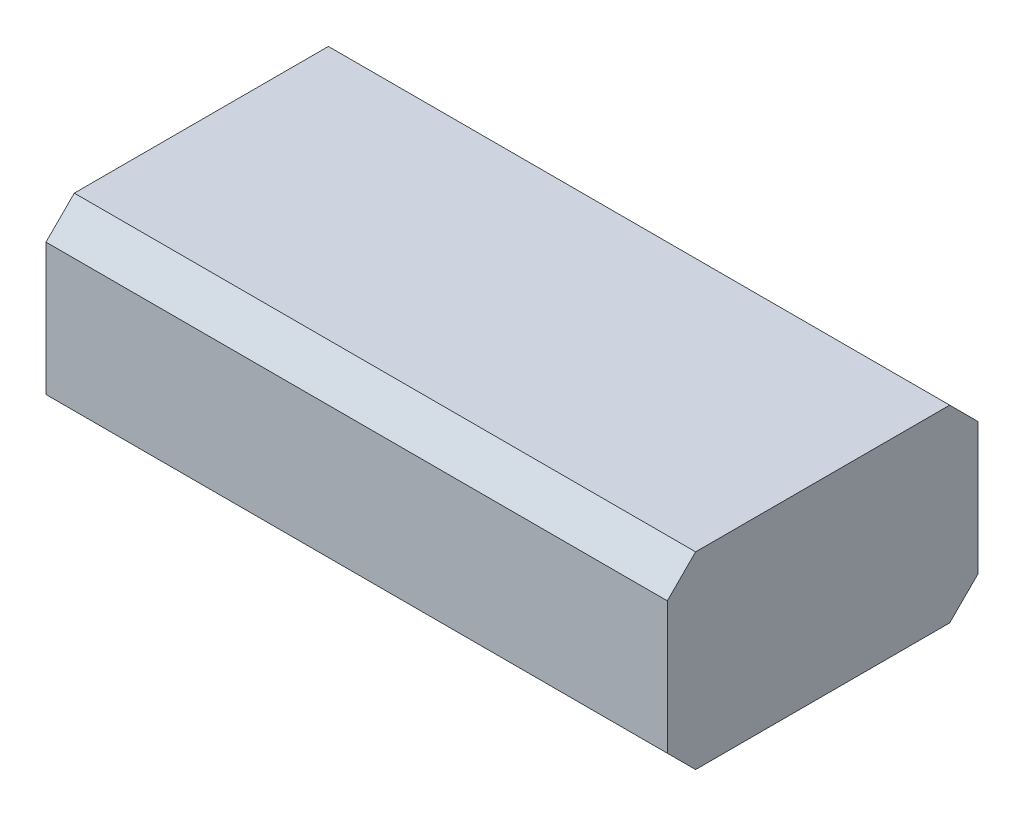
ISO-10303-21;
HEADER;
FILE_DESCRIPTION(('STEP AP214'),'2;1');
FILE_NAME('part.step','',(''),(''),'','','');
FILE_SCHEMA(('AUTOMOTIVE_DESIGN { 1 0 10303 214 1 1 1 1 }'));
ENDSEC;
DATA;
#1=APPLICATION_CONTEXT('core data for automotive mechanical design processes');
#2=APPLICATION_PROTOCOL_DEFINITION('international standard','automotive_design',2000,#1);
#3=PRODUCT_CONTEXT('',#1,'mechanical');
#4=PRODUCT('Part','Part','',(#3));
#5=PRODUCT_RELATED_PRODUCT_CATEGORY('part','',(#4));
#6=PRODUCT_DEFINITION_FORMATION('','',#4);
#7=PRODUCT_DEFINITION_CONTEXT('part definition',#1,'design');
#8=PRODUCT_DEFINITION('design','',#6,#7);
#9=PRODUCT_DEFINITION_SHAPE('','',#8);
#10=(LENGTH_UNIT() NAMED_UNIT(*) SI_UNIT(.MILLI.,.METRE.));
#11=(NAMED_UNIT(*) PLANE_ANGLE_UNIT() SI_UNIT($,.RADIAN.));
#12=(NAMED_UNIT(*) SI_UNIT($,.STERADIAN.) SOLID_ANGLE_UNIT());
#13=UNCERTAINTY_MEASURE_WITH_UNIT(LENGTH_MEASURE(1.E-05),#10,'distance_accuracy_value','');
#14=(GEOMETRIC_REPRESENTATION_CONTEXT(3) GLOBAL_UNCERTAINTY_ASSIGNED_CONTEXT((#13)) GLOBAL_UNIT_ASSIGNED_CONTEXT((#10,
#11,#12)) REPRESENTATION_CONTEXT('',''));
#15=CARTESIAN_POINT('',(0.,0.,0.));
#16=DIRECTION('',(0.,0.,1.));
#17=DIRECTION('',(1.,0.,0.));
#18=AXIS2_PLACEMENT_3D('',#15,#16,#17);
#19=CARTESIAN_POINT('',(0.,0.,0.3295));
#20=DIRECTION('',(1.,0.,0.));
#21=DIRECTION('',(0.,0.,-1.));
#22=AXIS2_PLACEMENT_3D('',#19,#20,#21);
#23=PLANE('',#22);
#24=DIRECTION('',(0.,0.,-1.));
#25=VECTOR('',#24,1.);
#26=CARTESIAN_POINT('',(0.,0.2,0.3295));
#27=LINE('',#26,#25);
#28=CARTESIAN_POINT('',(0.,0.2,0.2995));
#29=VERTEX_POINT('',#28);
#30=CARTESIAN_POINT('',(0.,0.2,0.03));
#31=VERTEX_POINT('',#30);
#32=EDGE_CURVE('E112',#29,#31,#27,.T.);
#33=ORIENTED_EDGE('',*,*,#32,.T.);
#34=DIRECTION('',(0.,-0.707106781186549,-0.707106781186546));
#35=VECTOR('',#34,1.);
#36=CARTESIAN_POINT('',(0.,0.2,0.03));
#37=LINE('',#36,#35);
#38=CARTESIAN_POINT('',(0.,0.17,0.));
#39=VERTEX_POINT('',#38);
#40=EDGE_CURVE('E152',#31,#39,#37,.T.);
#41=ORIENTED_EDGE('',*,*,#40,.T.);
#42=DIRECTION('',(0.,-1.,0.));
#43=VECTOR('',#42,1.);
#44=CARTESIAN_POINT('',(0.,0.,0.));
#45=LINE('',#44,#43);
#46=CARTESIAN_POINT('',(0.,0.0300000000000001,0.));
#47=VERTEX_POINT('',#46);
#48=EDGE_CURVE('E191',#39,#47,#45,.T.);
#49=ORIENTED_EDGE('',*,*,#48,.T.);
#50=DIRECTION('',(0.,-0.707106781186549,0.707106781186546));
#51=VECTOR('',#50,1.);
#52=CARTESIAN_POINT('',(0.,0.,0.03));
#53=LINE('',#52,#51);
#54=CARTESIAN_POINT('',(0.,0.,0.03));
#55=VERTEX_POINT('',#54);
#56=EDGE_CURVE('E119',#47,#55,#53,.T.);
#57=ORIENTED_EDGE('',*,*,#56,.T.);
#58=DIRECTION('',(0.,0.,-1.));
#59=VECTOR('',#58,1.);
#60=CARTESIAN_POINT('',(0.,0.,0.3295));
#61=LINE('',#60,#59);
#62=CARTESIAN_POINT('',(0.,0.,0.2995));
#63=VERTEX_POINT('',#62);
#64=EDGE_CURVE('E138',#63,#55,#61,.T.);
#65=ORIENTED_EDGE('',*,*,#64,.F.);
#66=DIRECTION('',(0.,-0.707106781186546,-0.707106781186549));
#67=VECTOR('',#66,1.);
#68=CARTESIAN_POINT('',(0.,0.03,0.3295));
#69=LINE('',#68,#67);
#70=CARTESIAN_POINT('',(0.,0.03,0.3295));
#71=VERTEX_POINT('',#70);
#72=EDGE_CURVE('E120',#63,#71,#69,.F.);
#73=ORIENTED_EDGE('',*,*,#72,.T.);
#74=DIRECTION('',(0.,-1.,0.));
#75=VECTOR('',#74,1.);
#76=CARTESIAN_POINT('',(0.,0.,0.3295));
#77=LINE('',#76,#75);
#78=CARTESIAN_POINT('',(0.,0.17,0.3295));
#79=VERTEX_POINT('',#78);
#80=EDGE_CURVE('E114',#79,#71,#77,.T.);
#81=ORIENTED_EDGE('',*,*,#80,.F.);
#82=DIRECTION('',(0.,-0.707106781186546,0.707106781186549));
#83=VECTOR('',#82,1.);
#84=CARTESIAN_POINT('',(0.,0.17,0.3295));
#85=LINE('',#84,#83);
#86=EDGE_CURVE('E110',#79,#29,#85,.F.);
#87=ORIENTED_EDGE('',*,*,#86,.T.);
#88=EDGE_LOOP('',(#33,#41,#49,#57,#65,#73,#81,#87));
#89=FACE_BOUND('',#88,.T.);
#90=ADVANCED_FACE('F41',(#89),#23,.F.);
#91=CARTESIAN_POINT('',(0.,0.,0.3295));
#92=DIRECTION('',(0.,1.,0.));
#93=DIRECTION('',(0.,0.,1.));
#94=AXIS2_PLACEMENT_3D('',#91,#92,#93);
#95=PLANE('',#94);
#96=ORIENTED_EDGE('',*,*,#64,.T.);
#97=DIRECTION('',(1.,0.,0.));
#98=VECTOR('',#97,1.);
#99=CARTESIAN_POINT('',(0.659,0.,0.03));
#100=LINE('',#99,#98);
#101=CARTESIAN_POINT('',(0.659,0.,0.03));
#102=VERTEX_POINT('',#101);
#103=EDGE_CURVE('E173',#55,#102,#100,.T.);
#104=ORIENTED_EDGE('',*,*,#103,.T.);
#105=DIRECTION('',(0.,0.,-1.));
#106=VECTOR('',#105,1.);
#107=CARTESIAN_POINT('',(0.659,0.,0.3295));
#108=LINE('',#107,#106);
#109=CARTESIAN_POINT('',(0.659,0.,0.2995));
#110=VERTEX_POINT('',#109);
#111=EDGE_CURVE('E144',#110,#102,#108,.T.);
#112=ORIENTED_EDGE('',*,*,#111,.F.);
#113=DIRECTION('',(-1.,0.,0.));
#114=VECTOR('',#113,1.);
#115=CARTESIAN_POINT('',(0.,0.,0.2995));
#116=LINE('',#115,#114);
#117=EDGE_CURVE('E170',#110,#63,#116,.T.);
#118=ORIENTED_EDGE('',*,*,#117,.T.);
#119=EDGE_LOOP('',(#96,#104,#112,#118));
#120=FACE_BOUND('',#119,.T.);
#121=ADVANCED_FACE('F202',(#120),#95,.F.);
#122=CARTESIAN_POINT('',(0.659,0.,0.3295));
#123=DIRECTION('',(-1.,0.,0.));
#124=DIRECTION('',(0.,0.,1.));
#125=AXIS2_PLACEMENT_3D('',#122,#123,#124);
#126=PLANE('',#125);
#127=DIRECTION('',(0.,1.,0.));
#128=VECTOR('',#127,1.);
#129=CARTESIAN_POINT('',(0.659,0.,0.));
#130=LINE('',#129,#128);
#131=CARTESIAN_POINT('',(0.659,0.0300000000000001,0.));
#132=VERTEX_POINT('',#131);
#133=CARTESIAN_POINT('',(0.659,0.17,0.));
#134=VERTEX_POINT('',#133);
#135=EDGE_CURVE('E188',#132,#134,#130,.T.);
#136=ORIENTED_EDGE('',*,*,#135,.T.);
#137=DIRECTION('',(0.,0.707106781186549,0.707106781186546));
#138=VECTOR('',#137,1.);
#139=CARTESIAN_POINT('',(0.659,0.2,0.03));
#140=LINE('',#139,#138);
#141=CARTESIAN_POINT('',(0.659,0.2,0.03));
#142=VERTEX_POINT('',#141);
#143=EDGE_CURVE('E167',#134,#142,#140,.T.);
#144=ORIENTED_EDGE('',*,*,#143,.T.);
#145=DIRECTION('',(0.,0.,-1.));
#146=VECTOR('',#145,1.);
#147=CARTESIAN_POINT('',(0.659,0.2,0.3295));
#148=LINE('',#147,#146);
#149=CARTESIAN_POINT('',(0.659,0.2,0.2995));
#150=VERTEX_POINT('',#149);
#151=EDGE_CURVE('E131',#150,#142,#148,.T.);
#152=ORIENTED_EDGE('',*,*,#151,.F.);
#153=DIRECTION('',(0.,0.707106781186546,-0.707106781186549));
#154=VECTOR('',#153,1.);
#155=CARTESIAN_POINT('',(0.659,0.17,0.3295));
#156=LINE('',#155,#154);
#157=CARTESIAN_POINT('',(0.659,0.17,0.3295));
#158=VERTEX_POINT('',#157);
#159=EDGE_CURVE('E136',#150,#158,#156,.F.);
#160=ORIENTED_EDGE('',*,*,#159,.T.);
#161=DIRECTION('',(0.,1.,0.));
#162=VECTOR('',#161,1.);
#163=CARTESIAN_POINT('',(0.659,0.,0.3295));
#164=LINE('',#163,#162);
#165=CARTESIAN_POINT('',(0.659,0.03,0.3295));
#166=VERTEX_POINT('',#165);
#167=EDGE_CURVE('E132',#166,#158,#164,.T.);
#168=ORIENTED_EDGE('',*,*,#167,.F.);
#169=DIRECTION('',(0.,0.707106781186546,0.707106781186549));
#170=VECTOR('',#169,1.);
#171=CARTESIAN_POINT('',(0.659,0.03,0.3295));
#172=LINE('',#171,#170);
#173=EDGE_CURVE('E66',#166,#110,#172,.F.);
#174=ORIENTED_EDGE('',*,*,#173,.T.);
#175=ORIENTED_EDGE('',*,*,#111,.T.);
#176=DIRECTION('',(0.,0.707106781186549,-0.707106781186546));
#177=VECTOR('',#176,1.);
#178=CARTESIAN_POINT('',(0.659,0.,0.03));
#179=LINE('',#178,#177);
#180=EDGE_CURVE('E58',#102,#132,#179,.T.);
#181=ORIENTED_EDGE('',*,*,#180,.T.);
#182=EDGE_LOOP('',(#136,#144,#152,#160,#168,#174,#175,#181));
#183=FACE_BOUND('',#182,.T.);
#184=ADVANCED_FACE('F184',(#183),#126,.F.);
#185=CARTESIAN_POINT('',(0.,0.2,0.3295));
#186=DIRECTION('',(0.,-1.,0.));
#187=DIRECTION('',(0.,0.,-1.));
#188=AXIS2_PLACEMENT_3D('',#185,#186,#187);
#189=PLANE('',#188);
#190=ORIENTED_EDGE('',*,*,#151,.T.);
#191=DIRECTION('',(-1.,0.,0.));
#192=VECTOR('',#191,1.);
#193=CARTESIAN_POINT('',(0.,0.2,0.03));
#194=LINE('',#193,#192);
#195=EDGE_CURVE('E129',#142,#31,#194,.T.);
#196=ORIENTED_EDGE('',*,*,#195,.T.);
#197=ORIENTED_EDGE('',*,*,#32,.F.);
#198=DIRECTION('',(1.,0.,0.));
#199=VECTOR('',#198,1.);
#200=CARTESIAN_POINT('',(0.,0.2,0.2995));
#201=LINE('',#200,#199);
#202=EDGE_CURVE('E126',#29,#150,#201,.T.);
#203=ORIENTED_EDGE('',*,*,#202,.T.);
#204=EDGE_LOOP('',(#190,#196,#197,#203));
#205=FACE_BOUND('',#204,.T.);
#206=ADVANCED_FACE('F125',(#205),#189,.F.);
#207=CARTESIAN_POINT('',(0.,0.,0.3295));
#208=DIRECTION('',(0.,0.,-1.));
#209=DIRECTION('',(-1.,0.,0.));
#210=AXIS2_PLACEMENT_3D('',#207,#208,#209);
#211=PLANE('',#210);
#212=ORIENTED_EDGE('',*,*,#167,.T.);
#213=DIRECTION('',(-1.,0.,0.));
#214=VECTOR('',#213,1.);
#215=CARTESIAN_POINT('',(0.,0.17,0.3295));
#216=LINE('',#215,#214);
#217=EDGE_CURVE('E11',#158,#79,#216,.T.);
#218=ORIENTED_EDGE('',*,*,#217,.T.);
#219=ORIENTED_EDGE('',*,*,#80,.T.);
#220=DIRECTION('',(1.,0.,0.));
#221=VECTOR('',#220,1.);
#222=CARTESIAN_POINT('',(0.,0.03,0.3295));
#223=LINE('',#222,#221);
#224=EDGE_CURVE('E51',#71,#166,#223,.T.);
#225=ORIENTED_EDGE('',*,*,#224,.T.);
#226=EDGE_LOOP('',(#212,#218,#219,#225));
#227=FACE_BOUND('',#226,.T.);
#228=ADVANCED_FACE('F180',(#227),#211,.F.);
#229=CARTESIAN_POINT('',(0.,0.,0.));
#230=DIRECTION('',(0.,0.,-1.));
#231=DIRECTION('',(-1.,0.,0.));
#232=AXIS2_PLACEMENT_3D('',#229,#230,#231);
#233=PLANE('',#232);
#234=ORIENTED_EDGE('',*,*,#48,.F.);
#235=DIRECTION('',(1.,0.,0.));
#236=VECTOR('',#235,1.);
#237=CARTESIAN_POINT('',(0.659,0.17,0.));
#238=LINE('',#237,#236);
#239=EDGE_CURVE('E158',#39,#134,#238,.T.);
#240=ORIENTED_EDGE('',*,*,#239,.T.);
#241=ORIENTED_EDGE('',*,*,#135,.F.);
#242=DIRECTION('',(-1.,0.,0.));
#243=VECTOR('',#242,1.);
#244=CARTESIAN_POINT('',(0.,0.0300000000000001,0.));
#245=LINE('',#244,#243);
#246=EDGE_CURVE('E155',#132,#47,#245,.T.);
#247=ORIENTED_EDGE('',*,*,#246,.T.);
#248=EDGE_LOOP('',(#234,#240,#241,#247));
#249=FACE_BOUND('',#248,.T.);
#250=ADVANCED_FACE('F208',(#249),#233,.T.);
#251=CARTESIAN_POINT('',(0.,0.2,0.03));
#252=DIRECTION('',(0.,0.707106781186546,-0.707106781186549));
#253=DIRECTION('',(1.,0.,0.));
#254=AXIS2_PLACEMENT_3D('',#251,#252,#253);
#255=PLANE('',#254);
#256=ORIENTED_EDGE('',*,*,#143,.F.);
#257=ORIENTED_EDGE('',*,*,#239,.F.);
#258=ORIENTED_EDGE('',*,*,#40,.F.);
#259=ORIENTED_EDGE('',*,*,#195,.F.);
#260=EDGE_LOOP('',(#256,#257,#258,#259));
#261=FACE_BOUND('',#260,.T.);
#262=ADVANCED_FACE('F212',(#261),#255,.T.);
#263=CARTESIAN_POINT('',(0.,0.,0.03));
#264=DIRECTION('',(0.,-0.707106781186546,-0.707106781186549));
#265=DIRECTION('',(-1.,0.,0.));
#266=AXIS2_PLACEMENT_3D('',#263,#264,#265);
#267=PLANE('',#266);
#268=ORIENTED_EDGE('',*,*,#56,.F.);
#269=ORIENTED_EDGE('',*,*,#246,.F.);
#270=ORIENTED_EDGE('',*,*,#180,.F.);
#271=ORIENTED_EDGE('',*,*,#103,.F.);
#272=EDGE_LOOP('',(#268,#269,#270,#271));
#273=FACE_BOUND('',#272,.T.);
#274=ADVANCED_FACE('F205',(#273),#267,.T.);
#275=CARTESIAN_POINT('',(0.,0.17,0.3295));
#276=DIRECTION('',(0.,-0.707106781186549,-0.707106781186546));
#277=DIRECTION('',(-1.,0.,0.));
#278=AXIS2_PLACEMENT_3D('',#275,#276,#277);
#279=PLANE('',#278);
#280=ORIENTED_EDGE('',*,*,#159,.F.);
#281=ORIENTED_EDGE('',*,*,#202,.F.);
#282=ORIENTED_EDGE('',*,*,#86,.F.);
#283=ORIENTED_EDGE('',*,*,#217,.F.);
#284=EDGE_LOOP('',(#280,#281,#282,#283));
#285=FACE_BOUND('',#284,.T.);
#286=ADVANCED_FACE('F135',(#285),#279,.F.);
#287=CARTESIAN_POINT('',(0.,0.03,0.3295));
#288=DIRECTION('',(0.,0.707106781186549,-0.707106781186546));
#289=DIRECTION('',(1.,0.,0.));
#290=AXIS2_PLACEMENT_3D('',#287,#288,#289);
#291=PLANE('',#290);
#292=ORIENTED_EDGE('',*,*,#72,.F.);
#293=ORIENTED_EDGE('',*,*,#117,.F.);
#294=ORIENTED_EDGE('',*,*,#173,.F.);
#295=ORIENTED_EDGE('',*,*,#224,.F.);
#296=EDGE_LOOP('',(#292,#293,#294,#295));
#297=FACE_BOUND('',#296,.T.);
#298=ADVANCED_FACE('F44',(#297),#291,.F.);
#299=CLOSED_SHELL('',(#90,#121,#184,#206,#228,#250,#262,#274,#286,#298));
#300=MANIFOLD_SOLID_BREP('B2',#299);
#301=ADVANCED_BREP_SHAPE_REPRESENTATION('',(#18,#300),#14);
#302=SHAPE_DEFINITION_REPRESENTATION(#9,#301);
ENDSEC;
END-ISO-10303-21;
